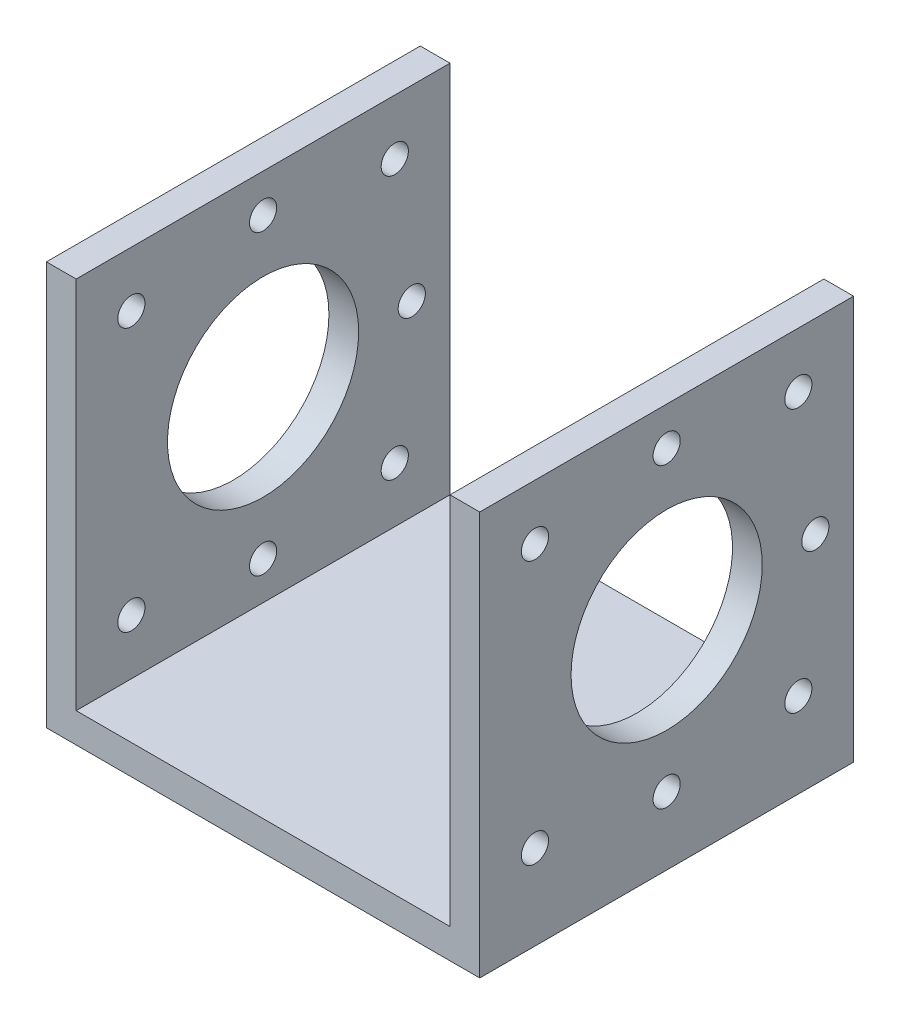
ISO-10303-21;
HEADER;
FILE_DESCRIPTION(('STEP AP214'),'2;1');
FILE_NAME('part.step','',(''),(''),'','','');
FILE_SCHEMA(('AUTOMOTIVE_DESIGN { 1 0 10303 214 1 1 1 1 }'));
ENDSEC;
DATA;
#1=APPLICATION_CONTEXT('core data for automotive mechanical design processes');
#2=APPLICATION_PROTOCOL_DEFINITION('international standard','automotive_design',2000,#1);
#3=PRODUCT_CONTEXT('',#1,'mechanical');
#4=PRODUCT('Part','Part','',(#3));
#5=PRODUCT_RELATED_PRODUCT_CATEGORY('part','',(#4));
#6=PRODUCT_DEFINITION_FORMATION('','',#4);
#7=PRODUCT_DEFINITION_CONTEXT('part definition',#1,'design');
#8=PRODUCT_DEFINITION('design','',#6,#7);
#9=PRODUCT_DEFINITION_SHAPE('','',#8);
#10=(LENGTH_UNIT() NAMED_UNIT(*) SI_UNIT(.MILLI.,.METRE.));
#11=(NAMED_UNIT(*) PLANE_ANGLE_UNIT() SI_UNIT($,.RADIAN.));
#12=(NAMED_UNIT(*) SI_UNIT($,.STERADIAN.) SOLID_ANGLE_UNIT());
#13=UNCERTAINTY_MEASURE_WITH_UNIT(LENGTH_MEASURE(1.E-05),#10,'distance_accuracy_value','');
#14=(GEOMETRIC_REPRESENTATION_CONTEXT(3) GLOBAL_UNCERTAINTY_ASSIGNED_CONTEXT((#13)) GLOBAL_UNIT_ASSIGNED_CONTEXT((#10,
#11,#12)) REPRESENTATION_CONTEXT('',''));
#15=CARTESIAN_POINT('',(0.,0.,0.));
#16=DIRECTION('',(0.,0.,1.));
#17=DIRECTION('',(1.,0.,0.));
#18=AXIS2_PLACEMENT_3D('',#15,#16,#17);
#19=CARTESIAN_POINT('',(-22.,-3.5,22.));
#20=DIRECTION('',(0.,0.,1.));
#21=DIRECTION('',(1.,0.,0.));
#22=AXIS2_PLACEMENT_3D('',#19,#20,#21);
#23=PLANE('',#22);
#24=DIRECTION('',(1.,0.,0.));
#25=VECTOR('',#24,1.);
#26=CARTESIAN_POINT('',(-22.,0.,22.));
#27=LINE('',#26,#25);
#28=CARTESIAN_POINT('',(-22.,0.,22.));
#29=VERTEX_POINT('',#28);
#30=CARTESIAN_POINT('',(22.,0.,22.));
#31=VERTEX_POINT('',#30);
#32=EDGE_CURVE('E167',#29,#31,#27,.T.);
#33=ORIENTED_EDGE('',*,*,#32,.F.);
#34=DIRECTION('',(0.,1.,0.));
#35=VECTOR('',#34,1.);
#36=CARTESIAN_POINT('',(-22.,-3.5,22.));
#37=LINE('',#36,#35);
#38=CARTESIAN_POINT('',(-22.,44.,22.));
#39=VERTEX_POINT('',#38);
#40=EDGE_CURVE('E59',#29,#39,#37,.T.);
#41=ORIENTED_EDGE('',*,*,#40,.T.);
#42=DIRECTION('',(1.,0.,0.));
#43=VECTOR('',#42,1.);
#44=CARTESIAN_POINT('',(-22.,44.,22.));
#45=LINE('',#44,#43);
#46=CARTESIAN_POINT('',(-25.5,44.,22.));
#47=VERTEX_POINT('',#46);
#48=EDGE_CURVE('E128',#47,#39,#45,.T.);
#49=ORIENTED_EDGE('',*,*,#48,.F.);
#50=DIRECTION('',(0.,1.,0.));
#51=VECTOR('',#50,1.);
#52=CARTESIAN_POINT('',(-25.5,-3.5,22.));
#53=LINE('',#52,#51);
#54=CARTESIAN_POINT('',(-25.5,-3.5,22.));
#55=VERTEX_POINT('',#54);
#56=EDGE_CURVE('E142',#55,#47,#53,.T.);
#57=ORIENTED_EDGE('',*,*,#56,.F.);
#58=DIRECTION('',(1.,0.,0.));
#59=VECTOR('',#58,1.);
#60=CARTESIAN_POINT('',(-22.,-3.5,22.));
#61=LINE('',#60,#59);
#62=CARTESIAN_POINT('',(25.5,-3.5,22.));
#63=VERTEX_POINT('',#62);
#64=EDGE_CURVE('E11',#55,#63,#61,.T.);
#65=ORIENTED_EDGE('',*,*,#64,.T.);
#66=DIRECTION('',(0.,1.,0.));
#67=VECTOR('',#66,1.);
#68=CARTESIAN_POINT('',(25.5,-3.5,22.));
#69=LINE('',#68,#67);
#70=CARTESIAN_POINT('',(25.5,44.,22.));
#71=VERTEX_POINT('',#70);
#72=EDGE_CURVE('E164',#63,#71,#69,.T.);
#73=ORIENTED_EDGE('',*,*,#72,.T.);
#74=DIRECTION('',(1.,0.,0.));
#75=VECTOR('',#74,1.);
#76=CARTESIAN_POINT('',(22.,44.,22.));
#77=LINE('',#76,#75);
#78=CARTESIAN_POINT('',(22.,44.,22.));
#79=VERTEX_POINT('',#78);
#80=EDGE_CURVE('E147',#79,#71,#77,.T.);
#81=ORIENTED_EDGE('',*,*,#80,.F.);
#82=DIRECTION('',(0.,1.,0.));
#83=VECTOR('',#82,1.);
#84=CARTESIAN_POINT('',(22.,-3.5,22.));
#85=LINE('',#84,#83);
#86=EDGE_CURVE('E159',#31,#79,#85,.T.);
#87=ORIENTED_EDGE('',*,*,#86,.F.);
#88=EDGE_LOOP('',(#33,#41,#49,#57,#65,#73,#81,#87));
#89=FACE_BOUND('',#88,.T.);
#90=ADVANCED_FACE('F42',(#89),#23,.T.);
#91=CARTESIAN_POINT('',(-22.,-3.5,-22.));
#92=DIRECTION('',(0.,0.,-1.));
#93=DIRECTION('',(-1.,0.,0.));
#94=AXIS2_PLACEMENT_3D('',#91,#92,#93);
#95=PLANE('',#94);
#96=DIRECTION('',(-1.,0.,0.));
#97=VECTOR('',#96,1.);
#98=CARTESIAN_POINT('',(-22.,0.,-22.));
#99=LINE('',#98,#97);
#100=CARTESIAN_POINT('',(22.,0.,-22.));
#101=VERTEX_POINT('',#100);
#102=CARTESIAN_POINT('',(-22.,0.,-22.));
#103=VERTEX_POINT('',#102);
#104=EDGE_CURVE('E171',#101,#103,#99,.T.);
#105=ORIENTED_EDGE('',*,*,#104,.F.);
#106=DIRECTION('',(0.,1.,0.));
#107=VECTOR('',#106,1.);
#108=CARTESIAN_POINT('',(22.,-3.5,-22.));
#109=LINE('',#108,#107);
#110=CARTESIAN_POINT('',(22.,44.,-22.));
#111=VERTEX_POINT('',#110);
#112=EDGE_CURVE('E67',#101,#111,#109,.T.);
#113=ORIENTED_EDGE('',*,*,#112,.T.);
#114=DIRECTION('',(-1.,0.,0.));
#115=VECTOR('',#114,1.);
#116=CARTESIAN_POINT('',(22.,44.,-22.));
#117=LINE('',#116,#115);
#118=CARTESIAN_POINT('',(25.5,44.,-22.));
#119=VERTEX_POINT('',#118);
#120=EDGE_CURVE('E153',#119,#111,#117,.T.);
#121=ORIENTED_EDGE('',*,*,#120,.F.);
#122=DIRECTION('',(0.,1.,0.));
#123=VECTOR('',#122,1.);
#124=CARTESIAN_POINT('',(25.5,-3.5,-22.));
#125=LINE('',#124,#123);
#126=CARTESIAN_POINT('',(25.5,-3.5,-22.));
#127=VERTEX_POINT('',#126);
#128=EDGE_CURVE('E162',#127,#119,#125,.T.);
#129=ORIENTED_EDGE('',*,*,#128,.F.);
#130=DIRECTION('',(-1.,0.,0.));
#131=VECTOR('',#130,1.);
#132=CARTESIAN_POINT('',(-22.,-3.5,-22.));
#133=LINE('',#132,#131);
#134=CARTESIAN_POINT('',(-25.5,-3.5,-22.));
#135=VERTEX_POINT('',#134);
#136=EDGE_CURVE('E51',#127,#135,#133,.T.);
#137=ORIENTED_EDGE('',*,*,#136,.T.);
#138=DIRECTION('',(0.,1.,0.));
#139=VECTOR('',#138,1.);
#140=CARTESIAN_POINT('',(-25.5,-3.5,-22.));
#141=LINE('',#140,#139);
#142=CARTESIAN_POINT('',(-25.5,44.,-22.));
#143=VERTEX_POINT('',#142);
#144=EDGE_CURVE('E114',#135,#143,#141,.T.);
#145=ORIENTED_EDGE('',*,*,#144,.T.);
#146=DIRECTION('',(-1.,0.,0.));
#147=VECTOR('',#146,1.);
#148=CARTESIAN_POINT('',(-22.,44.,-22.));
#149=LINE('',#148,#147);
#150=CARTESIAN_POINT('',(-22.,44.,-22.));
#151=VERTEX_POINT('',#150);
#152=EDGE_CURVE('E118',#151,#143,#149,.T.);
#153=ORIENTED_EDGE('',*,*,#152,.F.);
#154=DIRECTION('',(0.,1.,0.));
#155=VECTOR('',#154,1.);
#156=CARTESIAN_POINT('',(-22.,-3.5,-22.));
#157=LINE('',#156,#155);
#158=EDGE_CURVE('E106',#103,#151,#157,.T.);
#159=ORIENTED_EDGE('',*,*,#158,.F.);
#160=EDGE_LOOP('',(#105,#113,#121,#129,#137,#145,#153,#159));
#161=FACE_BOUND('',#160,.T.);
#162=ADVANCED_FACE('F44',(#161),#95,.T.);
#163=CARTESIAN_POINT('',(0.,-3.5,0.));
#164=DIRECTION('',(0.,-1.,0.));
#165=DIRECTION('',(0.,0.,-1.));
#166=AXIS2_PLACEMENT_3D('',#163,#164,#165);
#167=PLANE('',#166);
#168=ORIENTED_EDGE('',*,*,#136,.F.);
#169=DIRECTION('',(0.,0.,-1.));
#170=VECTOR('',#169,1.);
#171=CARTESIAN_POINT('',(25.5,-3.5,22.));
#172=LINE('',#171,#170);
#173=EDGE_CURVE('E156',#63,#127,#172,.T.);
#174=ORIENTED_EDGE('',*,*,#173,.F.);
#175=ORIENTED_EDGE('',*,*,#64,.F.);
#176=DIRECTION('',(0.,0.,1.));
#177=VECTOR('',#176,1.);
#178=CARTESIAN_POINT('',(-25.5,-3.5,-22.));
#179=LINE('',#178,#177);
#180=EDGE_CURVE('E115',#135,#55,#179,.T.);
#181=ORIENTED_EDGE('',*,*,#180,.F.);
#182=EDGE_LOOP('',(#168,#174,#175,#181));
#183=FACE_BOUND('',#182,.T.);
#184=ADVANCED_FACE('F233',(#183),#167,.T.);
#185=CARTESIAN_POINT('',(0.,0.,0.));
#186=DIRECTION('',(0.,-1.,0.));
#187=DIRECTION('',(0.,0.,-1.));
#188=AXIS2_PLACEMENT_3D('',#185,#186,#187);
#189=PLANE('',#188);
#190=DIRECTION('',(0.,0.,-1.));
#191=VECTOR('',#190,1.);
#192=CARTESIAN_POINT('',(22.,0.,22.));
#193=LINE('',#192,#191);
#194=EDGE_CURVE('E161',#31,#101,#193,.T.);
#195=ORIENTED_EDGE('',*,*,#194,.T.);
#196=ORIENTED_EDGE('',*,*,#104,.T.);
#197=DIRECTION('',(0.,0.,1.));
#198=VECTOR('',#197,1.);
#199=CARTESIAN_POINT('',(-22.,0.,22.));
#200=LINE('',#199,#198);
#201=EDGE_CURVE('E111',#103,#29,#200,.T.);
#202=ORIENTED_EDGE('',*,*,#201,.T.);
#203=ORIENTED_EDGE('',*,*,#32,.T.);
#204=EDGE_LOOP('',(#195,#196,#202,#203));
#205=FACE_BOUND('',#204,.T.);
#206=ADVANCED_FACE('F221',(#205),#189,.F.);
#207=CARTESIAN_POINT('',(22.,-3.5,22.));
#208=DIRECTION('',(-1.,0.,0.));
#209=DIRECTION('',(0.,0.,1.));
#210=AXIS2_PLACEMENT_3D('',#207,#208,#209);
#211=PLANE('',#210);
#212=CARTESIAN_POINT('',(22.,39.5,0.));
#213=DIRECTION('',(-1.,0.,0.));
#214=DIRECTION('',(0.,0.,1.));
#215=AXIS2_PLACEMENT_3D('',#212,#213,#214);
#216=CIRCLE('',#215,1.59999999999999);
#217=CARTESIAN_POINT('',(22.,39.5,1.59999999999999));
#218=VERTEX_POINT('',#217);
#219=EDGE_CURVE('E451',#218,#218,#216,.T.);
#220=ORIENTED_EDGE('',*,*,#219,.F.);
#221=EDGE_LOOP('',(#220));
#222=FACE_BOUND('',#221,.T.);
#223=CARTESIAN_POINT('',(22.,4.5,0.));
#224=DIRECTION('',(-1.,0.,0.));
#225=DIRECTION('',(0.,0.,1.));
#226=AXIS2_PLACEMENT_3D('',#223,#224,#225);
#227=CIRCLE('',#226,1.59999999999999);
#228=CARTESIAN_POINT('',(22.,4.5,1.59999999999999));
#229=VERTEX_POINT('',#228);
#230=EDGE_CURVE('E46',#229,#229,#227,.T.);
#231=ORIENTED_EDGE('',*,*,#230,.F.);
#232=EDGE_LOOP('',(#231));
#233=FACE_BOUND('',#232,.T.);
#234=CARTESIAN_POINT('',(22.,22.,-17.5));
#235=DIRECTION('',(-1.,0.,0.));
#236=DIRECTION('',(0.,0.,1.));
#237=AXIS2_PLACEMENT_3D('',#234,#235,#236);
#238=CIRCLE('',#237,1.59999999999999);
#239=CARTESIAN_POINT('',(22.,22.,-15.9));
#240=VERTEX_POINT('',#239);
#241=EDGE_CURVE('E458',#240,#240,#238,.T.);
#242=ORIENTED_EDGE('',*,*,#241,.F.);
#243=EDGE_LOOP('',(#242));
#244=FACE_BOUND('',#243,.T.);
#245=CARTESIAN_POINT('',(22.,37.5,15.5));
#246=DIRECTION('',(-1.,0.,0.));
#247=DIRECTION('',(0.,0.,1.));
#248=AXIS2_PLACEMENT_3D('',#245,#246,#247);
#249=CIRCLE('',#248,1.59999999999999);
#250=CARTESIAN_POINT('',(22.,37.5,17.1));
#251=VERTEX_POINT('',#250);
#252=EDGE_CURVE('E462',#251,#251,#249,.T.);
#253=ORIENTED_EDGE('',*,*,#252,.F.);
#254=EDGE_LOOP('',(#253));
#255=FACE_BOUND('',#254,.T.);
#256=CARTESIAN_POINT('',(22.,37.5,-15.5));
#257=DIRECTION('',(-1.,0.,0.));
#258=DIRECTION('',(0.,0.,1.));
#259=AXIS2_PLACEMENT_3D('',#256,#257,#258);
#260=CIRCLE('',#259,1.59999999999999);
#261=CARTESIAN_POINT('',(22.,37.5,-13.9));
#262=VERTEX_POINT('',#261);
#263=EDGE_CURVE('E466',#262,#262,#260,.T.);
#264=ORIENTED_EDGE('',*,*,#263,.F.);
#265=EDGE_LOOP('',(#264));
#266=FACE_BOUND('',#265,.T.);
#267=CARTESIAN_POINT('',(22.,6.5,-15.5));
#268=DIRECTION('',(-1.,0.,0.));
#269=DIRECTION('',(0.,0.,1.));
#270=AXIS2_PLACEMENT_3D('',#267,#268,#269);
#271=CIRCLE('',#270,1.59999999999999);
#272=CARTESIAN_POINT('',(22.,6.5,-13.9));
#273=VERTEX_POINT('',#272);
#274=EDGE_CURVE('E190',#273,#273,#271,.T.);
#275=ORIENTED_EDGE('',*,*,#274,.F.);
#276=EDGE_LOOP('',(#275));
#277=FACE_BOUND('',#276,.T.);
#278=CARTESIAN_POINT('',(22.,6.5,15.5));
#279=DIRECTION('',(-1.,0.,0.));
#280=DIRECTION('',(0.,0.,1.));
#281=AXIS2_PLACEMENT_3D('',#278,#279,#280);
#282=CIRCLE('',#281,1.59999999999999);
#283=CARTESIAN_POINT('',(22.,6.5,17.1));
#284=VERTEX_POINT('',#283);
#285=EDGE_CURVE('E177',#284,#284,#282,.T.);
#286=ORIENTED_EDGE('',*,*,#285,.F.);
#287=EDGE_LOOP('',(#286));
#288=FACE_BOUND('',#287,.T.);
#289=CARTESIAN_POINT('',(22.,22.,0.));
#290=DIRECTION('',(-1.,0.,0.));
#291=DIRECTION('',(0.,0.,1.));
#292=AXIS2_PLACEMENT_3D('',#289,#290,#291);
#293=CIRCLE('',#292,11.25);
#294=CARTESIAN_POINT('',(22.,22.,11.25));
#295=VERTEX_POINT('',#294);
#296=EDGE_CURVE('E129',#295,#295,#293,.F.);
#297=ORIENTED_EDGE('',*,*,#296,.T.);
#298=EDGE_LOOP('',(#297));
#299=FACE_BOUND('',#298,.T.);
#300=ORIENTED_EDGE('',*,*,#194,.F.);
#301=ORIENTED_EDGE('',*,*,#86,.T.);
#302=DIRECTION('',(0.,0.,1.));
#303=VECTOR('',#302,1.);
#304=CARTESIAN_POINT('',(22.,44.,22.));
#305=LINE('',#304,#303);
#306=EDGE_CURVE('E141',#111,#79,#305,.T.);
#307=ORIENTED_EDGE('',*,*,#306,.F.);
#308=ORIENTED_EDGE('',*,*,#112,.F.);
#309=EDGE_LOOP('',(#300,#301,#307,#308));
#310=FACE_BOUND('',#309,.T.);
#311=ADVANCED_FACE('F227',(#222,#233,#244,#255,#266,#277,#288,#299,#310),#211,.T.);
#312=CARTESIAN_POINT('',(25.5,-3.5,22.));
#313=DIRECTION('',(1.,0.,0.));
#314=DIRECTION('',(0.,0.,-1.));
#315=AXIS2_PLACEMENT_3D('',#312,#313,#314);
#316=PLANE('',#315);
#317=CARTESIAN_POINT('',(25.5,39.5,0.));
#318=DIRECTION('',(-1.,0.,0.));
#319=DIRECTION('',(0.,0.,1.));
#320=AXIS2_PLACEMENT_3D('',#317,#318,#319);
#321=CIRCLE('',#320,1.59999999999999);
#322=CARTESIAN_POINT('',(25.5,39.5,1.59999999999999));
#323=VERTEX_POINT('',#322);
#324=EDGE_CURVE('E517',#323,#323,#321,.T.);
#325=ORIENTED_EDGE('',*,*,#324,.T.);
#326=EDGE_LOOP('',(#325));
#327=FACE_BOUND('',#326,.T.);
#328=CARTESIAN_POINT('',(25.5,4.5,0.));
#329=DIRECTION('',(-1.,0.,0.));
#330=DIRECTION('',(0.,0.,1.));
#331=AXIS2_PLACEMENT_3D('',#328,#329,#330);
#332=CIRCLE('',#331,1.59999999999999);
#333=CARTESIAN_POINT('',(25.5,4.5,1.59999999999999));
#334=VERTEX_POINT('',#333);
#335=EDGE_CURVE('E513',#334,#334,#332,.T.);
#336=ORIENTED_EDGE('',*,*,#335,.T.);
#337=EDGE_LOOP('',(#336));
#338=FACE_BOUND('',#337,.T.);
#339=CARTESIAN_POINT('',(25.5,22.,-17.5));
#340=DIRECTION('',(-1.,0.,0.));
#341=DIRECTION('',(0.,0.,1.));
#342=AXIS2_PLACEMENT_3D('',#339,#340,#341);
#343=CIRCLE('',#342,1.59999999999999);
#344=CARTESIAN_POINT('',(25.5,22.,-15.9));
#345=VERTEX_POINT('',#344);
#346=EDGE_CURVE('E510',#345,#345,#343,.T.);
#347=ORIENTED_EDGE('',*,*,#346,.T.);
#348=EDGE_LOOP('',(#347));
#349=FACE_BOUND('',#348,.T.);
#350=CARTESIAN_POINT('',(25.5,37.5,15.5));
#351=DIRECTION('',(1.,0.,0.));
#352=DIRECTION('',(0.,0.,-1.));
#353=AXIS2_PLACEMENT_3D('',#350,#351,#352);
#354=CIRCLE('',#353,1.59999999999998);
#355=CARTESIAN_POINT('',(25.5,37.5,13.9));
#356=VERTEX_POINT('',#355);
#357=EDGE_CURVE('E506',#356,#356,#354,.T.);
#358=ORIENTED_EDGE('',*,*,#357,.F.);
#359=EDGE_LOOP('',(#358));
#360=FACE_BOUND('',#359,.T.);
#361=CARTESIAN_POINT('',(25.5,37.5,-15.5));
#362=DIRECTION('',(1.,0.,0.));
#363=DIRECTION('',(0.,0.,-1.));
#364=AXIS2_PLACEMENT_3D('',#361,#362,#363);
#365=CIRCLE('',#364,1.59999999999998);
#366=CARTESIAN_POINT('',(25.5,37.5,-17.1));
#367=VERTEX_POINT('',#366);
#368=EDGE_CURVE('E496',#367,#367,#365,.T.);
#369=ORIENTED_EDGE('',*,*,#368,.F.);
#370=EDGE_LOOP('',(#369));
#371=FACE_BOUND('',#370,.T.);
#372=CARTESIAN_POINT('',(25.5,6.5,-15.5));
#373=DIRECTION('',(1.,0.,0.));
#374=DIRECTION('',(0.,0.,-1.));
#375=AXIS2_PLACEMENT_3D('',#372,#373,#374);
#376=CIRCLE('',#375,1.59999999999999);
#377=CARTESIAN_POINT('',(25.5,6.5,-17.1));
#378=VERTEX_POINT('',#377);
#379=EDGE_CURVE('E486',#378,#378,#376,.T.);
#380=ORIENTED_EDGE('',*,*,#379,.F.);
#381=EDGE_LOOP('',(#380));
#382=FACE_BOUND('',#381,.T.);
#383=CARTESIAN_POINT('',(25.5,6.5,15.5));
#384=DIRECTION('',(1.,0.,0.));
#385=DIRECTION('',(0.,0.,-1.));
#386=AXIS2_PLACEMENT_3D('',#383,#384,#385);
#387=CIRCLE('',#386,1.59999999999999);
#388=CARTESIAN_POINT('',(25.5,6.5,13.9));
#389=VERTEX_POINT('',#388);
#390=EDGE_CURVE('E185',#389,#389,#387,.T.);
#391=ORIENTED_EDGE('',*,*,#390,.F.);
#392=EDGE_LOOP('',(#391));
#393=FACE_BOUND('',#392,.T.);
#394=CARTESIAN_POINT('',(25.5,22.,0.));
#395=DIRECTION('',(1.,0.,0.));
#396=DIRECTION('',(0.,0.,-1.));
#397=AXIS2_PLACEMENT_3D('',#394,#395,#396);
#398=CIRCLE('',#397,11.25);
#399=CARTESIAN_POINT('',(25.5,22.,-11.25));
#400=VERTEX_POINT('',#399);
#401=EDGE_CURVE('E196',#400,#400,#398,.T.);
#402=ORIENTED_EDGE('',*,*,#401,.F.);
#403=EDGE_LOOP('',(#402));
#404=FACE_BOUND('',#403,.T.);
#405=ORIENTED_EDGE('',*,*,#128,.T.);
#406=DIRECTION('',(0.,0.,-1.));
#407=VECTOR('',#406,1.);
#408=CARTESIAN_POINT('',(25.5,44.,22.));
#409=LINE('',#408,#407);
#410=EDGE_CURVE('E150',#71,#119,#409,.T.);
#411=ORIENTED_EDGE('',*,*,#410,.F.);
#412=ORIENTED_EDGE('',*,*,#72,.F.);
#413=ORIENTED_EDGE('',*,*,#173,.T.);
#414=EDGE_LOOP('',(#405,#411,#412,#413));
#415=FACE_BOUND('',#414,.T.);
#416=ADVANCED_FACE('F230',(#327,#338,#349,#360,#371,#382,#393,#404,#415),#316,.T.);
#417=CARTESIAN_POINT('',(0.,44.,0.));
#418=DIRECTION('',(0.,-1.,0.));
#419=DIRECTION('',(0.,0.,-1.));
#420=AXIS2_PLACEMENT_3D('',#417,#418,#419);
#421=PLANE('',#420);
#422=ORIENTED_EDGE('',*,*,#306,.T.);
#423=ORIENTED_EDGE('',*,*,#80,.T.);
#424=ORIENTED_EDGE('',*,*,#410,.T.);
#425=ORIENTED_EDGE('',*,*,#120,.T.);
#426=EDGE_LOOP('',(#422,#423,#424,#425));
#427=FACE_BOUND('',#426,.T.);
#428=ADVANCED_FACE('F225',(#427),#421,.F.);
#429=CARTESIAN_POINT('',(-22.,-3.5,-22.));
#430=DIRECTION('',(1.,0.,0.));
#431=DIRECTION('',(0.,0.,-1.));
#432=AXIS2_PLACEMENT_3D('',#429,#430,#431);
#433=PLANE('',#432);
#434=CARTESIAN_POINT('',(-22.,39.5,0.));
#435=DIRECTION('',(1.,0.,0.));
#436=DIRECTION('',(0.,0.,-1.));
#437=AXIS2_PLACEMENT_3D('',#434,#435,#436);
#438=CIRCLE('',#437,1.59999999999999);
#439=CARTESIAN_POINT('',(-22.,39.5,-1.59999999999999));
#440=VERTEX_POINT('',#439);
#441=EDGE_CURVE('E532',#440,#440,#438,.T.);
#442=ORIENTED_EDGE('',*,*,#441,.F.);
#443=EDGE_LOOP('',(#442));
#444=FACE_BOUND('',#443,.T.);
#445=CARTESIAN_POINT('',(-22.,22.,-17.5));
#446=DIRECTION('',(1.,0.,0.));
#447=DIRECTION('',(0.,0.,-1.));
#448=AXIS2_PLACEMENT_3D('',#445,#446,#447);
#449=CIRCLE('',#448,1.59999999999999);
#450=CARTESIAN_POINT('',(-22.,22.,-19.1));
#451=VERTEX_POINT('',#450);
#452=EDGE_CURVE('E526',#451,#451,#449,.T.);
#453=ORIENTED_EDGE('',*,*,#452,.F.);
#454=EDGE_LOOP('',(#453));
#455=FACE_BOUND('',#454,.T.);
#456=CARTESIAN_POINT('',(-22.,4.5,0.));
#457=DIRECTION('',(1.,0.,0.));
#458=DIRECTION('',(0.,0.,-1.));
#459=AXIS2_PLACEMENT_3D('',#456,#457,#458);
#460=CIRCLE('',#459,1.59999999999999);
#461=CARTESIAN_POINT('',(-22.,4.5,-1.59999999999998));
#462=VERTEX_POINT('',#461);
#463=EDGE_CURVE('E520',#462,#462,#460,.T.);
#464=ORIENTED_EDGE('',*,*,#463,.F.);
#465=EDGE_LOOP('',(#464));
#466=FACE_BOUND('',#465,.T.);
#467=CARTESIAN_POINT('',(-22.,37.5,15.5));
#468=DIRECTION('',(1.,0.,0.));
#469=DIRECTION('',(0.,0.,-1.));
#470=AXIS2_PLACEMENT_3D('',#467,#468,#469);
#471=CIRCLE('',#470,1.59999999999999);
#472=CARTESIAN_POINT('',(-22.,37.5,13.9));
#473=VERTEX_POINT('',#472);
#474=EDGE_CURVE('E500',#473,#473,#471,.T.);
#475=ORIENTED_EDGE('',*,*,#474,.F.);
#476=EDGE_LOOP('',(#475));
#477=FACE_BOUND('',#476,.T.);
#478=CARTESIAN_POINT('',(-22.,37.5,-15.5));
#479=DIRECTION('',(1.,0.,0.));
#480=DIRECTION('',(0.,0.,-1.));
#481=AXIS2_PLACEMENT_3D('',#478,#479,#480);
#482=CIRCLE('',#481,1.59999999999999);
#483=CARTESIAN_POINT('',(-22.,37.5,-17.1));
#484=VERTEX_POINT('',#483);
#485=EDGE_CURVE('E490',#484,#484,#482,.T.);
#486=ORIENTED_EDGE('',*,*,#485,.F.);
#487=EDGE_LOOP('',(#486));
#488=FACE_BOUND('',#487,.T.);
#489=CARTESIAN_POINT('',(-22.,6.5,-15.5));
#490=DIRECTION('',(1.,0.,0.));
#491=DIRECTION('',(0.,0.,-1.));
#492=AXIS2_PLACEMENT_3D('',#489,#490,#491);
#493=CIRCLE('',#492,1.59999999999999);
#494=CARTESIAN_POINT('',(-22.,6.5,-17.1));
#495=VERTEX_POINT('',#494);
#496=EDGE_CURVE('E479',#495,#495,#493,.T.);
#497=ORIENTED_EDGE('',*,*,#496,.F.);
#498=EDGE_LOOP('',(#497));
#499=FACE_BOUND('',#498,.T.);
#500=CARTESIAN_POINT('',(-22.,6.5,15.5));
#501=DIRECTION('',(1.,0.,0.));
#502=DIRECTION('',(0.,0.,-1.));
#503=AXIS2_PLACEMENT_3D('',#500,#501,#502);
#504=CIRCLE('',#503,1.59999999999999);
#505=CARTESIAN_POINT('',(-22.,6.5,13.9));
#506=VERTEX_POINT('',#505);
#507=EDGE_CURVE('E175',#506,#506,#504,.T.);
#508=ORIENTED_EDGE('',*,*,#507,.F.);
#509=EDGE_LOOP('',(#508));
#510=FACE_BOUND('',#509,.T.);
#511=CARTESIAN_POINT('',(-22.,22.,0.));
#512=DIRECTION('',(1.,0.,0.));
#513=DIRECTION('',(0.,0.,-1.));
#514=AXIS2_PLACEMENT_3D('',#511,#512,#513);
#515=CIRCLE('',#514,11.25);
#516=CARTESIAN_POINT('',(-22.,22.,-11.25));
#517=VERTEX_POINT('',#516);
#518=EDGE_CURVE('E132',#517,#517,#515,.F.);
#519=ORIENTED_EDGE('',*,*,#518,.T.);
#520=EDGE_LOOP('',(#519));
#521=FACE_BOUND('',#520,.T.);
#522=ORIENTED_EDGE('',*,*,#201,.F.);
#523=ORIENTED_EDGE('',*,*,#158,.T.);
#524=DIRECTION('',(0.,0.,-1.));
#525=VECTOR('',#524,1.);
#526=CARTESIAN_POINT('',(-22.,44.,-22.));
#527=LINE('',#526,#525);
#528=EDGE_CURVE('E110',#39,#151,#527,.T.);
#529=ORIENTED_EDGE('',*,*,#528,.F.);
#530=ORIENTED_EDGE('',*,*,#40,.F.);
#531=EDGE_LOOP('',(#522,#523,#529,#530));
#532=FACE_BOUND('',#531,.T.);
#533=ADVANCED_FACE('F108',(#444,#455,#466,#477,#488,#499,#510,#521,#532),#433,.T.);
#534=CARTESIAN_POINT('',(-25.5,-3.5,-22.));
#535=DIRECTION('',(-1.,0.,0.));
#536=DIRECTION('',(0.,0.,1.));
#537=AXIS2_PLACEMENT_3D('',#534,#535,#536);
#538=PLANE('',#537);
#539=CARTESIAN_POINT('',(-25.5,39.5,0.));
#540=DIRECTION('',(-1.,0.,0.));
#541=DIRECTION('',(0.,0.,1.));
#542=AXIS2_PLACEMENT_3D('',#539,#540,#541);
#543=CIRCLE('',#542,1.59999999999999);
#544=CARTESIAN_POINT('',(-25.5,39.5,1.59999999999999));
#545=VERTEX_POINT('',#544);
#546=EDGE_CURVE('E534',#545,#545,#543,.T.);
#547=ORIENTED_EDGE('',*,*,#546,.F.);
#548=EDGE_LOOP('',(#547));
#549=FACE_BOUND('',#548,.T.);
#550=CARTESIAN_POINT('',(-25.5,22.,-17.5));
#551=DIRECTION('',(-1.,0.,0.));
#552=DIRECTION('',(0.,0.,1.));
#553=AXIS2_PLACEMENT_3D('',#550,#551,#552);
#554=CIRCLE('',#553,1.59999999999999);
#555=CARTESIAN_POINT('',(-25.5,22.,-15.9));
#556=VERTEX_POINT('',#555);
#557=EDGE_CURVE('E529',#556,#556,#554,.T.);
#558=ORIENTED_EDGE('',*,*,#557,.F.);
#559=EDGE_LOOP('',(#558));
#560=FACE_BOUND('',#559,.T.);
#561=CARTESIAN_POINT('',(-25.5,4.5,0.));
#562=DIRECTION('',(-1.,0.,0.));
#563=DIRECTION('',(0.,0.,1.));
#564=AXIS2_PLACEMENT_3D('',#561,#562,#563);
#565=CIRCLE('',#564,1.59999999999999);
#566=CARTESIAN_POINT('',(-25.5,4.5,1.59999999999999));
#567=VERTEX_POINT('',#566);
#568=EDGE_CURVE('E523',#567,#567,#565,.T.);
#569=ORIENTED_EDGE('',*,*,#568,.F.);
#570=EDGE_LOOP('',(#569));
#571=FACE_BOUND('',#570,.T.);
#572=CARTESIAN_POINT('',(-25.5,37.5,15.5));
#573=DIRECTION('',(1.,0.,0.));
#574=DIRECTION('',(0.,0.,-1.));
#575=AXIS2_PLACEMENT_3D('',#572,#573,#574);
#576=CIRCLE('',#575,1.59999999999999);
#577=CARTESIAN_POINT('',(-25.5,37.5,13.9));
#578=VERTEX_POINT('',#577);
#579=EDGE_CURVE('E503',#578,#578,#576,.T.);
#580=ORIENTED_EDGE('',*,*,#579,.T.);
#581=EDGE_LOOP('',(#580));
#582=FACE_BOUND('',#581,.T.);
#583=CARTESIAN_POINT('',(-25.5,37.5,-15.5));
#584=DIRECTION('',(1.,0.,0.));
#585=DIRECTION('',(0.,0.,-1.));
#586=AXIS2_PLACEMENT_3D('',#583,#584,#585);
#587=CIRCLE('',#586,1.59999999999999);
#588=CARTESIAN_POINT('',(-25.5,37.5,-17.1));
#589=VERTEX_POINT('',#588);
#590=EDGE_CURVE('E493',#589,#589,#587,.T.);
#591=ORIENTED_EDGE('',*,*,#590,.T.);
#592=EDGE_LOOP('',(#591));
#593=FACE_BOUND('',#592,.T.);
#594=CARTESIAN_POINT('',(-25.5,6.5,-15.5));
#595=DIRECTION('',(1.,0.,0.));
#596=DIRECTION('',(0.,0.,-1.));
#597=AXIS2_PLACEMENT_3D('',#594,#595,#596);
#598=CIRCLE('',#597,1.59999999999999);
#599=CARTESIAN_POINT('',(-25.5,6.5,-17.1));
#600=VERTEX_POINT('',#599);
#601=EDGE_CURVE('E481',#600,#600,#598,.T.);
#602=ORIENTED_EDGE('',*,*,#601,.T.);
#603=EDGE_LOOP('',(#602));
#604=FACE_BOUND('',#603,.T.);
#605=CARTESIAN_POINT('',(-25.5,6.5,15.5));
#606=DIRECTION('',(1.,0.,0.));
#607=DIRECTION('',(0.,0.,-1.));
#608=AXIS2_PLACEMENT_3D('',#605,#606,#607);
#609=CIRCLE('',#608,1.59999999999999);
#610=CARTESIAN_POINT('',(-25.5,6.5,13.9));
#611=VERTEX_POINT('',#610);
#612=EDGE_CURVE('E178',#611,#611,#609,.T.);
#613=ORIENTED_EDGE('',*,*,#612,.T.);
#614=EDGE_LOOP('',(#613));
#615=FACE_BOUND('',#614,.T.);
#616=CARTESIAN_POINT('',(-25.5,22.,0.));
#617=DIRECTION('',(1.,0.,0.));
#618=DIRECTION('',(0.,0.,-1.));
#619=AXIS2_PLACEMENT_3D('',#616,#617,#618);
#620=CIRCLE('',#619,11.25);
#621=CARTESIAN_POINT('',(-25.5,22.,-11.25));
#622=VERTEX_POINT('',#621);
#623=EDGE_CURVE('E182',#622,#622,#620,.T.);
#624=ORIENTED_EDGE('',*,*,#623,.T.);
#625=EDGE_LOOP('',(#624));
#626=FACE_BOUND('',#625,.T.);
#627=ORIENTED_EDGE('',*,*,#56,.T.);
#628=DIRECTION('',(0.,0.,1.));
#629=VECTOR('',#628,1.);
#630=CARTESIAN_POINT('',(-25.5,44.,-22.));
#631=LINE('',#630,#629);
#632=EDGE_CURVE('E123',#143,#47,#631,.T.);
#633=ORIENTED_EDGE('',*,*,#632,.F.);
#634=ORIENTED_EDGE('',*,*,#144,.F.);
#635=ORIENTED_EDGE('',*,*,#180,.T.);
#636=EDGE_LOOP('',(#627,#633,#634,#635));
#637=FACE_BOUND('',#636,.T.);
#638=ADVANCED_FACE('F209',(#549,#560,#571,#582,#593,#604,#615,#626,#637),#538,.T.);
#639=CARTESIAN_POINT('',(0.,44.,0.));
#640=DIRECTION('',(0.,-1.,0.));
#641=DIRECTION('',(0.,0.,-1.));
#642=AXIS2_PLACEMENT_3D('',#639,#640,#641);
#643=PLANE('',#642);
#644=ORIENTED_EDGE('',*,*,#528,.T.);
#645=ORIENTED_EDGE('',*,*,#152,.T.);
#646=ORIENTED_EDGE('',*,*,#632,.T.);
#647=ORIENTED_EDGE('',*,*,#48,.T.);
#648=EDGE_LOOP('',(#644,#645,#646,#647));
#649=FACE_BOUND('',#648,.T.);
#650=ADVANCED_FACE('F126',(#649),#643,.F.);
#651=CARTESIAN_POINT('',(25.5,22.,0.));
#652=DIRECTION('',(-1.,0.,0.));
#653=DIRECTION('',(0.,0.,1.));
#654=AXIS2_PLACEMENT_3D('',#651,#652,#653);
#655=CYLINDRICAL_SURFACE('',#654,11.25);
#656=ORIENTED_EDGE('',*,*,#518,.F.);
#657=EDGE_LOOP('',(#656));
#658=FACE_BOUND('',#657,.T.);
#659=ORIENTED_EDGE('',*,*,#623,.F.);
#660=EDGE_LOOP('',(#659));
#661=FACE_BOUND('',#660,.T.);
#662=ADVANCED_FACE('F202',(#658,#661),#655,.F.);
#663=ORIENTED_EDGE('',*,*,#296,.F.);
#664=EDGE_LOOP('',(#663));
#665=FACE_BOUND('',#664,.T.);
#666=ORIENTED_EDGE('',*,*,#401,.T.);
#667=EDGE_LOOP('',(#666));
#668=FACE_BOUND('',#667,.T.);
#669=ADVANCED_FACE('F205',(#665,#668),#655,.F.);
#670=CARTESIAN_POINT('',(25.5,6.5,15.5));
#671=DIRECTION('',(1.,0.,0.));
#672=DIRECTION('',(0.,0.,-1.));
#673=AXIS2_PLACEMENT_3D('',#670,#671,#672);
#674=CYLINDRICAL_SURFACE('',#673,1.59999999999999);
#675=ORIENTED_EDGE('',*,*,#507,.T.);
#676=EDGE_LOOP('',(#675));
#677=FACE_BOUND('',#676,.T.);
#678=ORIENTED_EDGE('',*,*,#612,.F.);
#679=EDGE_LOOP('',(#678));
#680=FACE_BOUND('',#679,.T.);
#681=ADVANCED_FACE('F304',(#677,#680),#674,.F.);
#682=ORIENTED_EDGE('',*,*,#285,.T.);
#683=EDGE_LOOP('',(#682));
#684=FACE_BOUND('',#683,.T.);
#685=ORIENTED_EDGE('',*,*,#390,.T.);
#686=EDGE_LOOP('',(#685));
#687=FACE_BOUND('',#686,.T.);
#688=ADVANCED_FACE('F313',(#684,#687),#674,.F.);
#689=CARTESIAN_POINT('',(25.5,6.5,-15.5));
#690=DIRECTION('',(1.,0.,0.));
#691=DIRECTION('',(0.,0.,-1.));
#692=AXIS2_PLACEMENT_3D('',#689,#690,#691);
#693=CYLINDRICAL_SURFACE('',#692,1.59999999999999);
#694=ORIENTED_EDGE('',*,*,#496,.T.);
#695=EDGE_LOOP('',(#694));
#696=FACE_BOUND('',#695,.T.);
#697=ORIENTED_EDGE('',*,*,#601,.F.);
#698=EDGE_LOOP('',(#697));
#699=FACE_BOUND('',#698,.T.);
#700=ADVANCED_FACE('F322',(#696,#699),#693,.F.);
#701=ORIENTED_EDGE('',*,*,#274,.T.);
#702=EDGE_LOOP('',(#701));
#703=FACE_BOUND('',#702,.T.);
#704=ORIENTED_EDGE('',*,*,#379,.T.);
#705=EDGE_LOOP('',(#704));
#706=FACE_BOUND('',#705,.T.);
#707=ADVANCED_FACE('F331',(#703,#706),#693,.F.);
#708=CARTESIAN_POINT('',(25.5,37.5,-15.5));
#709=DIRECTION('',(1.,0.,0.));
#710=DIRECTION('',(0.,0.,-1.));
#711=AXIS2_PLACEMENT_3D('',#708,#709,#710);
#712=CYLINDRICAL_SURFACE('',#711,1.59999999999999);
#713=ORIENTED_EDGE('',*,*,#485,.T.);
#714=EDGE_LOOP('',(#713));
#715=FACE_BOUND('',#714,.T.);
#716=ORIENTED_EDGE('',*,*,#590,.F.);
#717=EDGE_LOOP('',(#716));
#718=FACE_BOUND('',#717,.T.);
#719=ADVANCED_FACE('F341',(#715,#718),#712,.F.);
#720=ORIENTED_EDGE('',*,*,#263,.T.);
#721=EDGE_LOOP('',(#720));
#722=FACE_BOUND('',#721,.T.);
#723=ORIENTED_EDGE('',*,*,#368,.T.);
#724=EDGE_LOOP('',(#723));
#725=FACE_BOUND('',#724,.T.);
#726=ADVANCED_FACE('F350',(#722,#725),#712,.F.);
#727=CARTESIAN_POINT('',(25.5,37.5,15.5));
#728=DIRECTION('',(1.,0.,0.));
#729=DIRECTION('',(0.,0.,-1.));
#730=AXIS2_PLACEMENT_3D('',#727,#728,#729);
#731=CYLINDRICAL_SURFACE('',#730,1.59999999999999);
#732=ORIENTED_EDGE('',*,*,#474,.T.);
#733=EDGE_LOOP('',(#732));
#734=FACE_BOUND('',#733,.T.);
#735=ORIENTED_EDGE('',*,*,#579,.F.);
#736=EDGE_LOOP('',(#735));
#737=FACE_BOUND('',#736,.T.);
#738=ADVANCED_FACE('F360',(#734,#737),#731,.F.);
#739=ORIENTED_EDGE('',*,*,#252,.T.);
#740=EDGE_LOOP('',(#739));
#741=FACE_BOUND('',#740,.T.);
#742=ORIENTED_EDGE('',*,*,#357,.T.);
#743=EDGE_LOOP('',(#742));
#744=FACE_BOUND('',#743,.T.);
#745=ADVANCED_FACE('F369',(#741,#744),#731,.F.);
#746=CARTESIAN_POINT('',(0.,22.,-17.5));
#747=DIRECTION('',(-1.,0.,0.));
#748=DIRECTION('',(0.,0.,1.));
#749=AXIS2_PLACEMENT_3D('',#746,#747,#748);
#750=CYLINDRICAL_SURFACE('',#749,1.59999999999999);
#751=ORIENTED_EDGE('',*,*,#241,.T.);
#752=EDGE_LOOP('',(#751));
#753=FACE_BOUND('',#752,.T.);
#754=ORIENTED_EDGE('',*,*,#346,.F.);
#755=EDGE_LOOP('',(#754));
#756=FACE_BOUND('',#755,.T.);
#757=ADVANCED_FACE('F379',(#753,#756),#750,.F.);
#758=CARTESIAN_POINT('',(0.,4.5,0.));
#759=DIRECTION('',(-1.,0.,0.));
#760=DIRECTION('',(0.,0.,1.));
#761=AXIS2_PLACEMENT_3D('',#758,#759,#760);
#762=CYLINDRICAL_SURFACE('',#761,1.59999999999999);
#763=ORIENTED_EDGE('',*,*,#230,.T.);
#764=EDGE_LOOP('',(#763));
#765=FACE_BOUND('',#764,.T.);
#766=ORIENTED_EDGE('',*,*,#335,.F.);
#767=EDGE_LOOP('',(#766));
#768=FACE_BOUND('',#767,.T.);
#769=ADVANCED_FACE('F389',(#765,#768),#762,.F.);
#770=CARTESIAN_POINT('',(0.,39.5,0.));
#771=DIRECTION('',(-1.,0.,0.));
#772=DIRECTION('',(0.,0.,1.));
#773=AXIS2_PLACEMENT_3D('',#770,#771,#772);
#774=CYLINDRICAL_SURFACE('',#773,1.59999999999999);
#775=ORIENTED_EDGE('',*,*,#219,.T.);
#776=EDGE_LOOP('',(#775));
#777=FACE_BOUND('',#776,.T.);
#778=ORIENTED_EDGE('',*,*,#324,.F.);
#779=EDGE_LOOP('',(#778));
#780=FACE_BOUND('',#779,.T.);
#781=ADVANCED_FACE('F400',(#777,#780),#774,.F.);
#782=CARTESIAN_POINT('',(-25.5,4.5,0.));
#783=DIRECTION('',(-1.,0.,0.));
#784=DIRECTION('',(0.,0.,1.));
#785=AXIS2_PLACEMENT_3D('',#782,#783,#784);
#786=CYLINDRICAL_SURFACE('',#785,1.59999999999999);
#787=ORIENTED_EDGE('',*,*,#463,.T.);
#788=EDGE_LOOP('',(#787));
#789=FACE_BOUND('',#788,.T.);
#790=ORIENTED_EDGE('',*,*,#568,.T.);
#791=EDGE_LOOP('',(#790));
#792=FACE_BOUND('',#791,.T.);
#793=ADVANCED_FACE('F409',(#789,#792),#786,.F.);
#794=CARTESIAN_POINT('',(-25.5,22.,-17.5));
#795=DIRECTION('',(-1.,0.,0.));
#796=DIRECTION('',(0.,0.,1.));
#797=AXIS2_PLACEMENT_3D('',#794,#795,#796);
#798=CYLINDRICAL_SURFACE('',#797,1.59999999999999);
#799=ORIENTED_EDGE('',*,*,#452,.T.);
#800=EDGE_LOOP('',(#799));
#801=FACE_BOUND('',#800,.T.);
#802=ORIENTED_EDGE('',*,*,#557,.T.);
#803=EDGE_LOOP('',(#802));
#804=FACE_BOUND('',#803,.T.);
#805=ADVANCED_FACE('F418',(#801,#804),#798,.F.);
#806=CARTESIAN_POINT('',(-25.5,39.5,0.));
#807=DIRECTION('',(-1.,0.,0.));
#808=DIRECTION('',(0.,0.,1.));
#809=AXIS2_PLACEMENT_3D('',#806,#807,#808);
#810=CYLINDRICAL_SURFACE('',#809,1.59999999999999);
#811=ORIENTED_EDGE('',*,*,#441,.T.);
#812=EDGE_LOOP('',(#811));
#813=FACE_BOUND('',#812,.T.);
#814=ORIENTED_EDGE('',*,*,#546,.T.);
#815=EDGE_LOOP('',(#814));
#816=FACE_BOUND('',#815,.T.);
#817=ADVANCED_FACE('F428',(#813,#816),#810,.F.);
#818=CLOSED_SHELL('',(#90,#162,#184,#206,#311,#416,#428,#533,#638,#650,#662,#669,#681,#688,#700,
#707,#719,#726,#738,#745,#757,#769,#781,#793,#805,#817));
#819=MANIFOLD_SOLID_BREP('B2',#818);
#820=ADVANCED_BREP_SHAPE_REPRESENTATION('',(#18,#819),#14);
#821=SHAPE_DEFINITION_REPRESENTATION(#9,#820);
ENDSEC;
END-ISO-10303-21;
